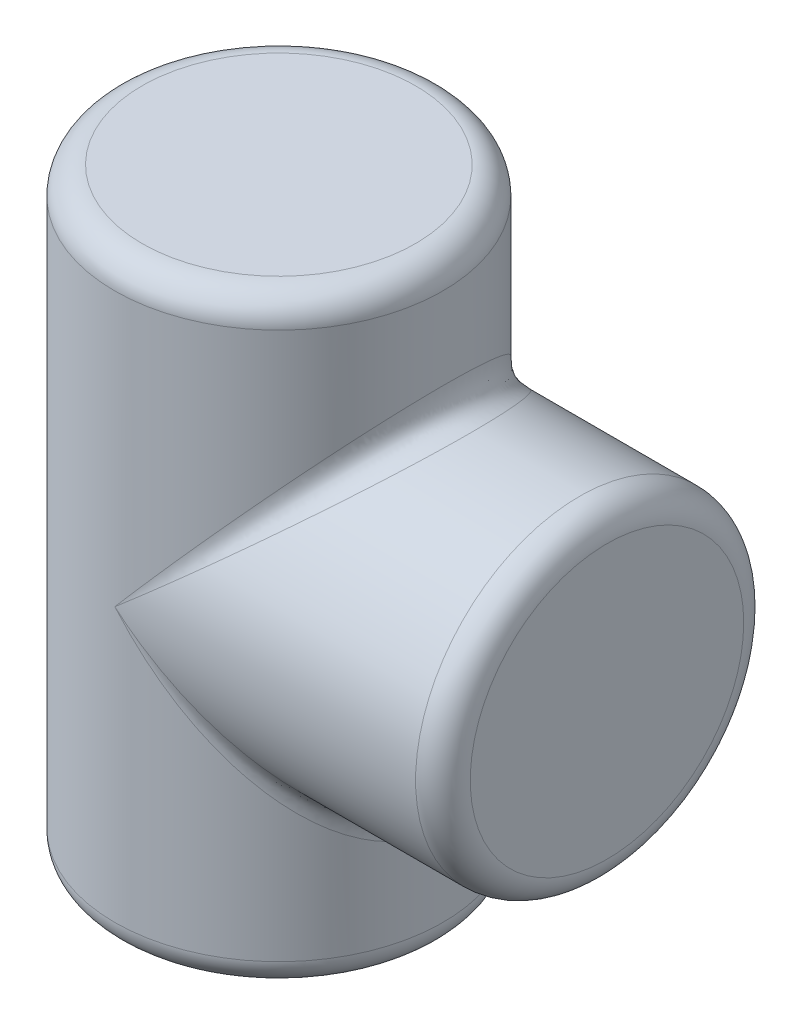
ISO-10303-21;
HEADER;
FILE_DESCRIPTION(('STEP AP214'),'2;1');
FILE_NAME('part.step','',(''),(''),'','','');
FILE_SCHEMA(('AUTOMOTIVE_DESIGN { 1 0 10303 214 1 1 1 1 }'));
ENDSEC;
DATA;
#1=APPLICATION_CONTEXT('core data for automotive mechanical design processes');
#2=APPLICATION_PROTOCOL_DEFINITION('international standard','automotive_design',2000,#1);
#3=PRODUCT_CONTEXT('',#1,'mechanical');
#4=PRODUCT('Part','Part','',(#3));
#5=PRODUCT_RELATED_PRODUCT_CATEGORY('part','',(#4));
#6=PRODUCT_DEFINITION_FORMATION('','',#4);
#7=PRODUCT_DEFINITION_CONTEXT('part definition',#1,'design');
#8=PRODUCT_DEFINITION('design','',#6,#7);
#9=PRODUCT_DEFINITION_SHAPE('','',#8);
#10=(LENGTH_UNIT() NAMED_UNIT(*) SI_UNIT(.MILLI.,.METRE.));
#11=(NAMED_UNIT(*) PLANE_ANGLE_UNIT() SI_UNIT($,.RADIAN.));
#12=(NAMED_UNIT(*) SI_UNIT($,.STERADIAN.) SOLID_ANGLE_UNIT());
#13=UNCERTAINTY_MEASURE_WITH_UNIT(LENGTH_MEASURE(1.E-05),#10,'distance_accuracy_value','');
#14=(GEOMETRIC_REPRESENTATION_CONTEXT(3) GLOBAL_UNCERTAINTY_ASSIGNED_CONTEXT((#13)) GLOBAL_UNIT_ASSIGNED_CONTEXT((#10,
#11,#12)) REPRESENTATION_CONTEXT('',''));
#15=CARTESIAN_POINT('',(0.,0.,0.));
#16=DIRECTION('',(0.,0.,1.));
#17=DIRECTION('',(1.,0.,0.));
#18=AXIS2_PLACEMENT_3D('',#15,#16,#17);
#19=CARTESIAN_POINT('',(0.,220.,0.));
#20=DIRECTION('',(0.,-1.,0.));
#21=DIRECTION('',(0.,0.,-1.));
#22=AXIS2_PLACEMENT_3D('',#19,#20,#21);
#23=CYLINDRICAL_SURFACE('',#22,60.);
#24=CARTESIAN_POINT('',(0.,10.,0.));
#25=DIRECTION('',(0.,1.,0.));
#26=DIRECTION('',(0.,0.,1.));
#27=AXIS2_PLACEMENT_3D('',#24,#25,#26);
#28=CIRCLE('',#27,60.);
#29=CARTESIAN_POINT('',(0.,10.,60.));
#30=VERTEX_POINT('',#29);
#31=EDGE_CURVE('E184',#30,#30,#28,.T.);
#32=ORIENTED_EDGE('',*,*,#31,.T.);
#33=EDGE_LOOP('',(#32));
#34=FACE_BOUND('',#33,.T.);
#35=CARTESIAN_POINT('',(0.,210.,0.));
#36=DIRECTION('',(0.,1.,0.));
#37=DIRECTION('',(0.,0.,1.));
#38=AXIS2_PLACEMENT_3D('',#35,#36,#37);
#39=CIRCLE('',#38,60.);
#40=CARTESIAN_POINT('',(0.,210.,60.));
#41=VERTEX_POINT('',#40);
#42=EDGE_CURVE('E181',#41,#41,#39,.F.);
#43=ORIENTED_EDGE('',*,*,#42,.T.);
#44=EDGE_LOOP('',(#43));
#45=FACE_BOUND('',#44,.T.);
#46=CARTESIAN_POINT('',(0.,110.,-60.));
#47=CARTESIAN_POINT('',(3.92699081712083,114.581489286634,-60.));
#48=CARTESIAN_POINT('',(11.7808596037151,123.744336204337,-59.226456743875));
#49=CARTESIAN_POINT('',(23.1090210871226,136.960524601642,-55.7901023416001));
#50=CARTESIAN_POINT('',(33.5490916992271,149.140606982432,-50.2097655937874));
#51=CARTESIAN_POINT('',(42.6998960030261,159.816545336864,-42.6998957121664));
#52=CARTESIAN_POINT('',(50.209765515825,168.578059768462,-33.5490927847041));
#53=CARTESIAN_POINT('',(55.79010236259,175.088452756355,-23.1090170360737));
#54=CARTESIAN_POINT('',(59.2264567378779,179.097532860858,-11.780874722433));
#55=CARTESIAN_POINT('',(60.386771631061,180.451233569571,-1.05978448090734E-13));
#56=CARTESIAN_POINT('',(59.2264567378779,179.097532860858,11.7808747224331));
#57=CARTESIAN_POINT('',(55.79010236259,175.088452756355,23.1090170360738));
#58=CARTESIAN_POINT('',(50.2097655158249,168.578059768462,33.5490927847042));
#59=CARTESIAN_POINT('',(42.6998960030264,159.816545336864,42.6998957121662));
#60=CARTESIAN_POINT('',(33.5490916992269,149.14060698243,50.2097655937875));
#61=CARTESIAN_POINT('',(23.1090210871227,136.960524601648,55.7901023416001));
#62=CARTESIAN_POINT('',(11.7808596037149,123.744336204316,59.2264567438751));
#63=CARTESIAN_POINT('',(3.92699081712081,114.581489286679,59.9999999999999));
#64=CARTESIAN_POINT('',(0.,110.,59.9999999999999));
#65=B_SPLINE_CURVE_WITH_KNOTS('',3,(#46,#47,#48,#49,#50,#51,#52,#53,#54,#55,#56,#57,#58,#59,#60,
#61,#62,#63,#64),.UNSPECIFIED.,.F.,.F.,(4,1,1,1,1,1,1,1,1,1,1,1,1,1,1,1,4),(1.5707963267949,
1.76714586764426,1.96349540849362,2.15984494934298,2.35619449019235,2.55254403104171,
2.74889357189107,2.94524311274043,3.14159265358979,3.33794219443915,3.53429173528852,
3.73064127613788,3.92699081698724,4.1233403578366,4.31968989868597,4.51603943953533,
4.71238898038469),.UNSPECIFIED.);
#66=CARTESIAN_POINT('',(0.,110.,60.));
#67=VERTEX_POINT('',#66);
#68=CARTESIAN_POINT('',(0.,110.,-60.));
#69=VERTEX_POINT('',#68);
#70=EDGE_CURVE('E63',#67,#69,#65,.F.);
#71=ORIENTED_EDGE('',*,*,#70,.T.);
#72=CARTESIAN_POINT('',(0.,110.,60.));
#73=CARTESIAN_POINT('',(3.92699081712083,105.418510713366,60.));
#74=CARTESIAN_POINT('',(11.7808596037151,96.2556637956627,59.226456743875));
#75=CARTESIAN_POINT('',(23.1090210871226,83.0394753983578,55.7901023416002));
#76=CARTESIAN_POINT('',(33.5490916992271,70.8593930175682,50.2097655937874));
#77=CARTESIAN_POINT('',(42.6998960030262,60.1834546631362,42.6998957121664));
#78=CARTESIAN_POINT('',(50.209765515825,51.4219402315375,33.5490927847041));
#79=CARTESIAN_POINT('',(55.7901023625901,44.9115472436449,23.1090170360737));
#80=CARTESIAN_POINT('',(59.226456737878,40.9024671391424,11.780874722433));
#81=CARTESIAN_POINT('',(60.386771631061,39.5487664304288,1.05978448090734E-13));
#82=CARTESIAN_POINT('',(59.226456737878,40.9024671391424,-11.7808747224331));
#83=CARTESIAN_POINT('',(55.79010236259,44.911547243645,-23.1090170360738));
#84=CARTESIAN_POINT('',(50.2097655158249,51.4219402315377,-33.5490927847042));
#85=CARTESIAN_POINT('',(42.6998960030264,60.1834546631356,-42.6998957121663));
#86=CARTESIAN_POINT('',(33.5490916992269,70.8593930175699,-50.2097655937875));
#87=CARTESIAN_POINT('',(23.1090210871227,83.0394753983522,-55.7901023416001));
#88=CARTESIAN_POINT('',(11.7808596037149,96.2556637956838,-59.2264567438751));
#89=CARTESIAN_POINT('',(3.92699081712081,105.418510713321,-60.));
#90=CARTESIAN_POINT('',(0.,110.,-60.));
#91=B_SPLINE_CURVE_WITH_KNOTS('',3,(#72,#73,#74,#75,#76,#77,#78,#79,#80,#81,#82,#83,#84,#85,#86,
#87,#88,#89,#90),.UNSPECIFIED.,.F.,.F.,(4,1,1,1,1,1,1,1,1,1,1,1,1,1,1,1,4),(1.5707963267949,
1.76714586764426,1.96349540849362,2.15984494934298,2.35619449019235,2.55254403104171,
2.74889357189107,2.94524311274043,3.14159265358979,3.33794219443915,3.53429173528852,
3.73064127613788,3.92699081698724,4.1233403578366,4.31968989868597,4.51603943953533,
4.71238898038469),.UNSPECIFIED.);
#92=EDGE_CURVE('E57',#69,#67,#91,.F.);
#93=ORIENTED_EDGE('',*,*,#92,.T.);
#94=EDGE_LOOP('',(#71,#93));
#95=FACE_BOUND('',#94,.T.);
#96=ADVANCED_FACE('F43',(#34,#45,#95),#23,.T.);
#97=CARTESIAN_POINT('',(0.,220.,0.));
#98=DIRECTION('',(0.,1.,0.));
#99=DIRECTION('',(0.,0.,1.));
#100=AXIS2_PLACEMENT_3D('',#97,#98,#99);
#101=PLANE('',#100);
#102=CARTESIAN_POINT('',(0.,220.,0.));
#103=DIRECTION('',(0.,1.,0.));
#104=DIRECTION('',(0.,0.,1.));
#105=AXIS2_PLACEMENT_3D('',#102,#103,#104);
#106=CIRCLE('',#105,50.);
#107=CARTESIAN_POINT('',(0.,220.,50.));
#108=VERTEX_POINT('',#107);
#109=EDGE_CURVE('E12',#108,#108,#106,.T.);
#110=ORIENTED_EDGE('',*,*,#109,.T.);
#111=EDGE_LOOP('',(#110));
#112=FACE_BOUND('',#111,.T.);
#113=ADVANCED_FACE('F198',(#112),#101,.T.);
#114=CARTESIAN_POINT('',(0.,0.,0.));
#115=DIRECTION('',(0.,1.,0.));
#116=DIRECTION('',(0.,0.,1.));
#117=AXIS2_PLACEMENT_3D('',#114,#115,#116);
#118=PLANE('',#117);
#119=CARTESIAN_POINT('',(0.,0.,0.));
#120=DIRECTION('',(0.,1.,0.));
#121=DIRECTION('',(0.,0.,1.));
#122=AXIS2_PLACEMENT_3D('',#119,#120,#121);
#123=CIRCLE('',#122,50.);
#124=CARTESIAN_POINT('',(0.,0.,50.));
#125=VERTEX_POINT('',#124);
#126=EDGE_CURVE('E51',#125,#125,#123,.F.);
#127=ORIENTED_EDGE('',*,*,#126,.T.);
#128=EDGE_LOOP('',(#127));
#129=FACE_BOUND('',#128,.T.);
#130=ADVANCED_FACE('F189',(#129),#118,.F.);
#131=CARTESIAN_POINT('',(120.,110.,0.));
#132=DIRECTION('',(-1.,0.,0.));
#133=DIRECTION('',(0.,0.,1.));
#134=AXIS2_PLACEMENT_3D('',#131,#132,#133);
#135=CYLINDRICAL_SURFACE('',#134,60.);
#136=CARTESIAN_POINT('',(110.,110.,0.));
#137=DIRECTION('',(1.,0.,0.));
#138=DIRECTION('',(0.,0.,-1.));
#139=AXIS2_PLACEMENT_3D('',#136,#137,#138);
#140=CIRCLE('',#139,60.);
#141=CARTESIAN_POINT('',(110.,110.,-60.));
#142=VERTEX_POINT('',#141);
#143=EDGE_CURVE('E178',#142,#142,#140,.F.);
#144=ORIENTED_EDGE('',*,*,#143,.T.);
#145=EDGE_LOOP('',(#144));
#146=FACE_BOUND('',#145,.T.);
#147=CARTESIAN_POINT('',(0.,110.,60.));
#148=CARTESIAN_POINT('',(4.58148928664094,113.926990817147,60.));
#149=CARTESIAN_POINT('',(13.744336204334,121.780859603703,59.2264567438751));
#150=CARTESIAN_POINT('',(26.9605246016431,133.109021087126,55.7901023416001));
#151=CARTESIAN_POINT('',(39.1406069824314,143.549091699226,50.2097655937875));
#152=CARTESIAN_POINT('',(49.8165453368641,152.699896003027,42.6998957121663));
#153=CARTESIAN_POINT('',(58.5780597684624,160.209765515825,33.5490927847042));
#154=CARTESIAN_POINT('',(65.0884527563551,165.79010236259,23.1090170360738));
#155=CARTESIAN_POINT('',(69.0975328608576,169.226456737878,11.7808747224331));
#156=CARTESIAN_POINT('',(70.4512335695712,170.386771631061,-1.05281221458558E-13));
#157=CARTESIAN_POINT('',(69.0975328608576,169.226456737878,-11.780874722433));
#158=CARTESIAN_POINT('',(65.0884527563551,165.79010236259,-23.1090170360737));
#159=CARTESIAN_POINT('',(58.5780597684625,160.209765515825,-33.5490927847041));
#160=CARTESIAN_POINT('',(49.8165453368639,152.699896003026,-42.6998957121664));
#161=CARTESIAN_POINT('',(39.1406069824316,143.549091699228,-50.2097655937874));
#162=CARTESIAN_POINT('',(26.9605246016431,133.10902108712,-55.7901023416002));
#163=CARTESIAN_POINT('',(13.7443362043342,121.780859603724,-59.226456743875));
#164=CARTESIAN_POINT('',(4.58148928664096,113.926990817102,-60.));
#165=CARTESIAN_POINT('',(0.,110.,-60.));
#166=B_SPLINE_CURVE_WITH_KNOTS('',3,(#147,#148,#149,#150,#151,#152,#153,#154,#155,#156,#157,
#158,#159,#160,#161,#162,#163,#164,#165),.UNSPECIFIED.,.F.,.F.,(4,1,1,1,1,1,1,1,1,1,1,1,1,1,1,1,
4),(1.5707963267949,1.76714586764426,1.96349540849362,2.15984494934298,2.35619449019234,
2.55254403104171,2.74889357189107,2.94524311274043,3.14159265358979,3.33794219443915,
3.53429173528852,3.73064127613788,3.92699081698724,4.1233403578366,4.31968989868597,
4.51603943953533,4.71238898038469),.UNSPECIFIED.);
#167=EDGE_CURVE('E67',#69,#67,#166,.F.);
#168=ORIENTED_EDGE('',*,*,#167,.T.);
#169=CARTESIAN_POINT('',(0.,110.,-60.));
#170=CARTESIAN_POINT('',(4.58148928664094,106.073009182853,-60.));
#171=CARTESIAN_POINT('',(13.744336204334,98.2191403962975,-59.2264567438751));
#172=CARTESIAN_POINT('',(26.9605246016431,86.890978912874,-55.7901023416001));
#173=CARTESIAN_POINT('',(39.1406069824314,76.450908300774,-50.2097655937875));
#174=CARTESIAN_POINT('',(49.8165453368641,67.3001039969733,-42.6998957121663));
#175=CARTESIAN_POINT('',(58.5780597684624,59.7902344841752,-33.5490927847042));
#176=CARTESIAN_POINT('',(65.088452756355,54.20989763741,-23.1090170360738));
#177=CARTESIAN_POINT('',(69.0975328608576,50.773543262122,-11.7808747224331));
#178=CARTESIAN_POINT('',(70.4512335695711,49.613228368939,1.05978448090734E-13));
#179=CARTESIAN_POINT('',(69.0975328608576,50.773543262122,11.780874722433));
#180=CARTESIAN_POINT('',(65.088452756355,54.20989763741,23.1090170360736));
#181=CARTESIAN_POINT('',(58.5780597684625,59.7902344841749,33.5490927847041));
#182=CARTESIAN_POINT('',(49.8165453368639,67.3001039969739,42.6998957121664));
#183=CARTESIAN_POINT('',(39.1406069824316,76.4509083007724,50.2097655937874));
#184=CARTESIAN_POINT('',(26.9605246016431,86.8909789128797,55.7901023416002));
#185=CARTESIAN_POINT('',(13.7443362043342,98.2191403962764,59.226456743875));
#186=CARTESIAN_POINT('',(4.58148928664096,106.073009182898,60.));
#187=CARTESIAN_POINT('',(0.,110.,60.));
#188=B_SPLINE_CURVE_WITH_KNOTS('',3,(#169,#170,#171,#172,#173,#174,#175,#176,#177,#178,#179,
#180,#181,#182,#183,#184,#185,#186,#187),.UNSPECIFIED.,.F.,.F.,(4,1,1,1,1,1,1,1,1,1,1,1,1,1,1,1,
4),(1.5707963267949,1.76714586764426,1.96349540849362,2.15984494934298,2.35619449019234,
2.55254403104171,2.74889357189107,2.94524311274043,3.14159265358979,3.33794219443915,
3.53429173528852,3.73064127613788,3.92699081698724,4.1233403578366,4.31968989868597,
4.51603943953533,4.71238898038469),.UNSPECIFIED.);
#189=EDGE_CURVE('E72',#67,#69,#188,.F.);
#190=ORIENTED_EDGE('',*,*,#189,.T.);
#191=EDGE_LOOP('',(#168,#190));
#192=FACE_BOUND('',#191,.T.);
#193=ADVANCED_FACE('F81',(#146,#192),#135,.T.);
#194=CARTESIAN_POINT('',(120.,110.,0.));
#195=DIRECTION('',(1.,0.,0.));
#196=DIRECTION('',(0.,0.,-1.));
#197=AXIS2_PLACEMENT_3D('',#194,#195,#196);
#198=PLANE('',#197);
#199=CARTESIAN_POINT('',(120.,110.,0.));
#200=DIRECTION('',(1.,0.,0.));
#201=DIRECTION('',(0.,0.,-1.));
#202=AXIS2_PLACEMENT_3D('',#199,#200,#201);
#203=CIRCLE('',#202,50.);
#204=CARTESIAN_POINT('',(120.,110.,-50.));
#205=VERTEX_POINT('',#204);
#206=EDGE_CURVE('E76',#205,#205,#203,.T.);
#207=ORIENTED_EDGE('',*,*,#206,.T.);
#208=EDGE_LOOP('',(#207));
#209=FACE_BOUND('',#208,.T.);
#210=ADVANCED_FACE('F107',(#209),#198,.T.);
#211=CARTESIAN_POINT('',(0.,110.,-60.));
#212=CARTESIAN_POINT('',(3.92699081712081,105.418510713321,-60.));
#213=CARTESIAN_POINT('',(11.7808596037149,96.2556637956838,-59.2264567438751));
#214=CARTESIAN_POINT('',(23.1090210871227,83.0394753983522,-55.7901023416001));
#215=CARTESIAN_POINT('',(33.5490916992269,70.8593930175699,-50.2097655937875));
#216=CARTESIAN_POINT('',(42.6998960030264,60.1834546631356,-42.6998957121663));
#217=CARTESIAN_POINT('',(50.2097655158249,51.4219402315377,-33.5490927847042));
#218=CARTESIAN_POINT('',(55.79010236259,44.911547243645,-23.1090170360738));
#219=CARTESIAN_POINT('',(59.226456737878,40.9024671391424,-11.7808747224331));
#220=CARTESIAN_POINT('',(60.386771631061,39.5487664304288,1.05978448090734E-13));
#221=CARTESIAN_POINT('',(59.226456737878,40.9024671391424,11.780874722433));
#222=CARTESIAN_POINT('',(55.7901023625901,44.9115472436449,23.1090170360737));
#223=CARTESIAN_POINT('',(50.209765515825,51.4219402315375,33.5490927847041));
#224=CARTESIAN_POINT('',(42.6998960030262,60.1834546631362,42.6998957121664));
#225=CARTESIAN_POINT('',(33.5490916992271,70.8593930175682,50.2097655937874));
#226=CARTESIAN_POINT('',(23.1090210871226,83.0394753983578,55.7901023416002));
#227=CARTESIAN_POINT('',(11.7808596037151,96.2556637956627,59.226456743875));
#228=CARTESIAN_POINT('',(3.92699081712083,105.418510713366,60.));
#229=CARTESIAN_POINT('',(0.,110.,60.));
#230=CARTESIAN_POINT('',(0.,110.,-60.));
#231=CARTESIAN_POINT('',(3.98664350439752,105.478163400681,-60.));
#232=CARTESIAN_POINT('',(11.9598067333234,96.4346231816255,-59.2026698226563));
#233=CARTESIAN_POINT('',(23.4366661492895,83.4083624080886,-55.6658036348682));
#234=CARTESIAN_POINT('',(33.9672536338786,71.4398826461201,-49.940556555725));
#235=CARTESIAN_POINT('',(43.1285251101186,61.0059540611247,-42.2780768391377));
#236=CARTESIAN_POINT('',(50.5603217487232,52.5179222028681,-33.0223427189622));
#237=CARTESIAN_POINT('',(55.9925249554958,46.292588167711,-22.5948226481385));
#238=CARTESIAN_POINT('',(59.2726561138483,42.5204499292783,-11.4517840915429));
#239=CARTESIAN_POINT('',(60.3636719431626,41.2627458084568,1.02840928245942E-13));
#240=CARTESIAN_POINT('',(59.2726561135012,42.5204499289312,11.4517840915428));
#241=CARTESIAN_POINT('',(55.9925249568844,46.2925881690995,22.5948226481384));
#242=CARTESIAN_POINT('',(50.5603217435161,52.5179221976609,33.0223427189621));
#243=CARTESIAN_POINT('',(43.1285251295583,61.0059540805644,42.2780768391379));
#244=CARTESIAN_POINT('',(33.9672535613259,71.439882573569,49.9405565557249));
#245=CARTESIAN_POINT('',(23.4366664200611,83.4083626788532,55.6658036348683));
#246=CARTESIAN_POINT('',(11.9598057227903,96.434622171118,59.2026698226562));
#247=CARTESIAN_POINT('',(3.98664568179429,105.478165578022,60.));
#248=CARTESIAN_POINT('',(0.,110.,60.));
#249=CARTESIAN_POINT('',(0.,110.,-60.));
#250=CARTESIAN_POINT('',(4.04686954777942,105.538389444159,-60.0000000000449));
#251=CARTESIAN_POINT('',(12.1404732791835,96.6153034854527,-59.1781965445143));
#252=CARTESIAN_POINT('',(23.7668429009911,83.7809451990786,-55.538028470656));
#253=CARTESIAN_POINT('',(34.3871044127039,72.0263629396363,-49.6643091010797));
#254=CARTESIAN_POINT('',(43.5561886856421,61.8366433788965,-41.8466912831429));
#255=CARTESIAN_POINT('',(50.9066788377484,53.6229692764953,-32.4867099293013));
#256=CARTESIAN_POINT('',(56.1898875987137,47.6805218637506,-22.0761702647969));
#257=CARTESIAN_POINT('',(59.3170604158285,44.1403702604925,-11.1225639180764));
#258=CARTESIAN_POINT('',(60.3414697922509,42.9757564159374,1.01097861665503E-13));
#259=CARTESIAN_POINT('',(59.3170604151677,44.1403702598317,11.1225639180762));
#260=CARTESIAN_POINT('',(56.1898876013569,47.6805218663937,22.0761702647967));
#261=CARTESIAN_POINT('',(50.9066788278365,53.6229692665834,32.4867099293012));
#262=CARTESIAN_POINT('',(43.5561887226466,61.8366434159008,41.846691283143));
#263=CARTESIAN_POINT('',(34.3871042745972,72.0263628015316,49.6643091010796));
#264=CARTESIAN_POINT('',(23.7668434164141,83.780945714493,55.5380284706561));
#265=CARTESIAN_POINT('',(12.1404713555985,96.6153015618998,59.1781965445142));
#266=CARTESIAN_POINT('',(4.04687369252963,105.538393588839,60.0000000000449));
#267=CARTESIAN_POINT('',(0.,110.,60.));
#268=CARTESIAN_POINT('',(0.,110.,-60.));
#269=CARTESIAN_POINT('',(4.185115550115,105.676635446181,-60.));
#270=CARTESIAN_POINT('',(12.5552015914663,97.0300582587543,-59.1337733520056));
#271=CARTESIAN_POINT('',(24.5457764249555,84.6368193595633,-55.3062373465043));
#272=CARTESIAN_POINT('',(35.431632323889,73.3728568602339,-49.163817959606));
#273=CARTESIAN_POINT('',(44.72756258341,63.7367147535694,-41.0670280507507));
#274=CARTESIAN_POINT('',(52.0468955405248,56.129653835681,-31.5226302269018));
#275=CARTESIAN_POINT('',(57.1668305825163,50.7899725703402,-21.1481775894253));
#276=CARTESIAN_POINT('',(60.0949697545576,47.7241738046179,-10.5371108862564));
#277=CARTESIAN_POINT('',(61.0278939202635,46.7445148154905,0.));
#278=CARTESIAN_POINT('',(60.0949697545533,47.7241738046134,10.5371108862563));
#279=CARTESIAN_POINT('',(57.1668305825337,50.7899725703577,21.1481775894251));
#280=CARTESIAN_POINT('',(52.0468955404598,56.1296538356151,31.5226302269017));
#281=CARTESIAN_POINT('',(44.727562583653,63.7367147538152,41.0670280507509));
#282=CARTESIAN_POINT('',(35.4316323229812,73.372856859317,49.1638179596058));
#283=CARTESIAN_POINT('',(24.545776428344,84.6368193629849,55.3062373465043));
#284=CARTESIAN_POINT('',(12.5552015788204,97.0300582459846,59.1337733520055));
#285=CARTESIAN_POINT('',(4.18511557736371,105.676635473695,60.));
#286=CARTESIAN_POINT('',(0.,110.,60.));
#287=CARTESIAN_POINT('',(0.,110.,-60.));
#288=CARTESIAN_POINT('',(4.32336303690225,105.814882933227,-60.));
#289=CARTESIAN_POINT('',(12.9699424452493,97.444799112417,-59.1337733520056));
#290=CARTESIAN_POINT('',(25.3631804517995,85.4542233864395,-55.3062373465043));
#291=CARTESIAN_POINT('',(36.6271431903115,74.5683677266478,-49.163817959606));
#292=CARTESIAN_POINT('',(46.2632852328862,65.272437403048,-41.0670280507507));
#293=CARTESIAN_POINT('',(53.8703461679513,57.9531044631068,-31.5226302269018));
#294=CARTESIAN_POINT('',(59.2100274286751,52.8331694164991,-21.1481775894253));
#295=CARTESIAN_POINT('',(62.2758261956888,49.905030245749,-10.5371108862564));
#296=CARTESIAN_POINT('',(63.2554851842678,48.9721060794947,0.));
#297=CARTESIAN_POINT('',(62.2758261960472,49.9050302461074,10.5371108862563));
#298=CARTESIAN_POINT('',(59.2100274272415,52.8331694150654,21.1481775894251));
#299=CARTESIAN_POINT('',(53.8703461733276,57.953104468483,31.5226302269017));
#300=CARTESIAN_POINT('',(46.2632852128148,65.2724373829767,41.0670280507509));
#301=CARTESIAN_POINT('',(36.6271432652204,74.5683678015567,49.1638179596058));
#302=CARTESIAN_POINT('',(25.3631801722361,85.4542231068749,55.3062373465043));
#303=CARTESIAN_POINT('',(12.9699434885944,97.4448001557662,59.1337733520055));
#304=CARTESIAN_POINT('',(4.32336078880647,105.814880685122,60.));
#305=CARTESIAN_POINT('',(0.,110.,60.));
#306=CARTESIAN_POINT('',(0.,110.,-60.));
#307=CARTESIAN_POINT('',(4.46161200877443,105.953131904849,-59.999999999955));
#308=CARTESIAN_POINT('',(13.3846958402386,97.8595260466494,-59.178196544556));
#309=CARTESIAN_POINT('',(26.2190549816019,86.2331572796515,-55.5380284706449));
#310=CARTESIAN_POINT('',(37.9736370119503,75.6128955388929,-49.6643091010827));
#311=CARTESIAN_POINT('',(48.1633566340765,66.4438113273281,-41.8466912831421));
#312=CARTESIAN_POINT('',(56.3770307200262,59.0933211587739,-32.4867099293015));
#313=CARTESIAN_POINT('',(62.3194781371904,53.8101124022271,-22.0761702647968));
#314=CARTESIAN_POINT('',(65.8596297392219,50.682939583886,-11.1225639180764));
#315=CARTESIAN_POINT('',(67.0242435842637,49.6585302079502,1.05629834774646E-13));
#316=CARTESIAN_POINT('',(65.8596297396495,50.6829395843135,11.1225639180762));
#317=CARTESIAN_POINT('',(62.3194781354803,53.810112400517,22.0761702647967));
#318=CARTESIAN_POINT('',(56.3770307264394,59.0933211651866,32.4867099293012));
#319=CARTESIAN_POINT('',(48.1633566101343,66.4438113033872,41.846691283143));
#320=CARTESIAN_POINT('',(37.9736371013055,75.6128956282445,49.6643091010796));
#321=CARTESIAN_POINT('',(26.219054648124,86.2331569461856,55.5380284706561));
#322=CARTESIAN_POINT('',(13.3846970847956,97.8595272911611,59.1781965445142));
#323=CARTESIAN_POINT('',(4.4616093271271,105.953129223298,60.0000000000449));
#324=CARTESIAN_POINT('',(0.,110.,60.));
#325=CARTESIAN_POINT('',(0.,110.,-60.));
#326=CARTESIAN_POINT('',(4.52183736823546,106.013357264328,-60.));
#327=CARTESIAN_POINT('',(13.565376461519,98.0401929099101,-59.2026698226563));
#328=CARTESIAN_POINT('',(26.5916376875306,86.5633339463058,-55.6658036348682));
#329=CARTESIAN_POINT('',(38.5601173282587,76.0327463405066,-49.940556555725));
#330=CARTESIAN_POINT('',(48.9940459457408,66.8714748967453,-42.2780768391377));
#331=CARTESIAN_POINT('',(57.4820777952911,59.4396782494364,-33.0223427189622));
#332=CARTESIAN_POINT('',(63.7074118327871,54.0074750450021,-22.5948226481385));
#333=CARTESIAN_POINT('',(67.4795500705705,50.7273438860005,-11.4517840915429));
#334=CARTESIAN_POINT('',(68.7372541916499,49.6363280569441,1.03538154878118E-13));
#335=CARTESIAN_POINT('',(67.4795500707933,50.7273438862233,11.4517840915428));
#336=CARTESIAN_POINT('',(63.7074118318958,54.0074750441108,22.5948226481384));
#337=CARTESIAN_POINT('',(57.4820777986337,59.4396782527785,33.0223427189621));
#338=CARTESIAN_POINT('',(48.994045933262,66.8714748842681,42.2780768391379));
#339=CARTESIAN_POINT('',(38.5601173748307,76.0327463870736,49.9405565557249));
#340=CARTESIAN_POINT('',(26.5916375137221,86.5633337725145,55.6658036348683));
#341=CARTESIAN_POINT('',(13.5653771101816,98.0401935585082,59.2026698226562));
#342=CARTESIAN_POINT('',(4.52183597056237,106.013355866792,60.));
#343=CARTESIAN_POINT('',(0.,110.,60.));
#344=CARTESIAN_POINT('',(0.,110.,-60.));
#345=CARTESIAN_POINT('',(4.58148928664094,106.073009182853,-60.));
#346=CARTESIAN_POINT('',(13.744336204334,98.2191403962975,-59.2264567438751));
#347=CARTESIAN_POINT('',(26.9605246016431,86.890978912874,-55.7901023416001));
#348=CARTESIAN_POINT('',(39.1406069824314,76.450908300774,-50.2097655937875));
#349=CARTESIAN_POINT('',(49.8165453368641,67.3001039969734,-42.6998957121663));
#350=CARTESIAN_POINT('',(58.5780597684624,59.7902344841752,-33.5490927847042));
#351=CARTESIAN_POINT('',(65.0884527563551,54.20989763741,-23.1090170360738));
#352=CARTESIAN_POINT('',(69.0975328608576,50.773543262122,-11.7808747224331));
#353=CARTESIAN_POINT('',(70.4512335695712,49.613228368939,1.05978448090734E-13));
#354=CARTESIAN_POINT('',(69.0975328608576,50.773543262122,11.780874722433));
#355=CARTESIAN_POINT('',(65.0884527563551,54.20989763741,23.1090170360737));
#356=CARTESIAN_POINT('',(58.5780597684625,59.7902344841749,33.5490927847041));
#357=CARTESIAN_POINT('',(49.8165453368639,67.300103996974,42.6998957121664));
#358=CARTESIAN_POINT('',(39.1406069824316,76.4509083007724,50.2097655937874));
#359=CARTESIAN_POINT('',(26.9605246016431,86.8909789128797,55.7901023416002));
#360=CARTESIAN_POINT('',(13.7443362043342,98.2191403962764,59.226456743875));
#361=CARTESIAN_POINT('',(4.58148928664096,106.073009182898,60.));
#362=CARTESIAN_POINT('',(0.,110.,60.));
#363=B_SPLINE_SURFACE_WITH_KNOTS('',5,3,((#211,#212,#213,#214,#215,#216,#217,#218,#219,#220,
#221,#222,#223,#224,#225,#226,#227,#228,#229),(#230,#231,#232,#233,#234,#235,#236,#237,#238,
#239,#240,#241,#242,#243,#244,#245,#246,#247,#248),(#249,#250,#251,#252,#253,#254,#255,#256,
#257,#258,#259,#260,#261,#262,#263,#264,#265,#266,#267),(#268,#269,#270,#271,#272,#273,#274,
#275,#276,#277,#278,#279,#280,#281,#282,#283,#284,#285,#286),(#287,#288,#289,#290,#291,#292,
#293,#294,#295,#296,#297,#298,#299,#300,#301,#302,#303,#304,#305),(#306,#307,#308,#309,#310,
#311,#312,#313,#314,#315,#316,#317,#318,#319,#320,#321,#322,#323,#324),(#325,#326,#327,#328,
#329,#330,#331,#332,#333,#334,#335,#336,#337,#338,#339,#340,#341,#342,#343),(#344,#345,#346,
#347,#348,#349,#350,#351,#352,#353,#354,#355,#356,#357,#358,#359,#360,#361,#362)),.UNSPECIFIED.,
.F.,.F.,.F.,(6,2,6),(4,1,1,1,1,1,1,1,1,1,1,1,1,1,1,1,4),(0.,0.5,1.),(1.5707963267949,
1.76714586764426,1.96349540849362,2.15984494934298,2.35619449019234,2.55254403104171,
2.74889357189107,2.94524311274043,3.14159265358979,3.33794219443915,3.53429173528852,
3.73064127613788,3.92699081698724,4.1233403578366,4.31968989868597,4.51603943953533,
4.71238898038469),.UNSPECIFIED.);
#364=ORIENTED_EDGE('',*,*,#189,.F.);
#365=ORIENTED_EDGE('',*,*,#92,.F.);
#366=EDGE_LOOP('',(#364,#365));
#367=FACE_BOUND('',#366,.T.);
#368=ADVANCED_FACE('F85',(#367),#363,.T.);
#369=CARTESIAN_POINT('',(0.,110.,60.));
#370=CARTESIAN_POINT('',(3.92699081712081,114.581489286679,60.));
#371=CARTESIAN_POINT('',(11.7808596037149,123.744336204316,59.2264567438751));
#372=CARTESIAN_POINT('',(23.1090210871227,136.960524601648,55.7901023416001));
#373=CARTESIAN_POINT('',(33.5490916992269,149.14060698243,50.2097655937875));
#374=CARTESIAN_POINT('',(42.6998960030264,159.816545336864,42.6998957121663));
#375=CARTESIAN_POINT('',(50.2097655158249,168.578059768462,33.5490927847042));
#376=CARTESIAN_POINT('',(55.79010236259,175.088452756355,23.1090170360738));
#377=CARTESIAN_POINT('',(59.226456737878,179.097532860858,11.7808747224331));
#378=CARTESIAN_POINT('',(60.386771631061,180.451233569571,-1.05978448090734E-13));
#379=CARTESIAN_POINT('',(59.226456737878,179.097532860858,-11.780874722433));
#380=CARTESIAN_POINT('',(55.7901023625901,175.088452756355,-23.1090170360737));
#381=CARTESIAN_POINT('',(50.209765515825,168.578059768463,-33.5490927847041));
#382=CARTESIAN_POINT('',(42.6998960030262,159.816545336864,-42.6998957121664));
#383=CARTESIAN_POINT('',(33.5490916992271,149.140606982432,-50.2097655937874));
#384=CARTESIAN_POINT('',(23.1090210871226,136.960524601642,-55.7901023416002));
#385=CARTESIAN_POINT('',(11.7808596037151,123.744336204337,-59.226456743875));
#386=CARTESIAN_POINT('',(3.92699081712083,114.581489286634,-60.));
#387=CARTESIAN_POINT('',(0.,110.,-60.));
#388=CARTESIAN_POINT('',(0.,110.,60.));
#389=CARTESIAN_POINT('',(3.9866435043802,114.521836599499,60.));
#390=CARTESIAN_POINT('',(11.9598067333314,123.565376818291,59.2026698226563));
#391=CARTESIAN_POINT('',(23.4366661492874,136.591637591934,55.6658036348682));
#392=CARTESIAN_POINT('',(33.9672536338792,148.560117353874,49.940556555725));
#393=CARTESIAN_POINT('',(43.1285251101184,158.994045938877,42.2780768391377));
#394=CARTESIAN_POINT('',(50.5603217487232,167.482077797132,33.0223427189622));
#395=CARTESIAN_POINT('',(55.9925249554958,173.707411832289,22.5948226481385));
#396=CARTESIAN_POINT('',(59.2726561138483,177.479550070722,11.4517840915429));
#397=CARTESIAN_POINT('',(60.3636719431626,178.737254191543,-1.03538154878118E-13));
#398=CARTESIAN_POINT('',(59.2726561135012,177.479550071069,-11.4517840915428));
#399=CARTESIAN_POINT('',(55.9925249568844,173.707411830901,-22.5948226481384));
#400=CARTESIAN_POINT('',(50.5603217435161,167.482077802339,-33.0223427189621));
#401=CARTESIAN_POINT('',(43.1285251295584,158.994045919436,-42.2780768391379));
#402=CARTESIAN_POINT('',(33.9672535613259,148.560117426431,-49.9405565557249));
#403=CARTESIAN_POINT('',(23.436666420061,136.591637321147,-55.6658036348683));
#404=CARTESIAN_POINT('',(11.9598057227903,123.565377828882,-59.2026698226562));
#405=CARTESIAN_POINT('',(3.98664568179429,114.521834421978,-60.));
#406=CARTESIAN_POINT('',(0.,110.,-60.));
#407=CARTESIAN_POINT('',(0.,110.,60.));
#408=CARTESIAN_POINT('',(4.04686954774621,114.461610556201,60.0000000000449));
#409=CARTESIAN_POINT('',(12.1404732791989,123.38469651438,59.1781965445143));
#410=CARTESIAN_POINT('',(23.766842900987,136.219054800966,55.5380284706561));
#411=CARTESIAN_POINT('',(34.387104412705,147.973637060352,49.6643091010797));
#412=CARTESIAN_POINT('',(43.5561886856419,158.163356621107,41.8466912831428));
#413=CARTESIAN_POINT('',(50.9066788377484,166.377030723504,32.4867099293013));
#414=CARTESIAN_POINT('',(56.1898875987137,172.31947813625,22.0761702647969));
#415=CARTESIAN_POINT('',(59.3170604158285,175.859629739507,11.1225639180764));
#416=CARTESIAN_POINT('',(60.3414697922509,177.024243584063,-1.00749248349415E-13));
#417=CARTESIAN_POINT('',(59.3170604151677,175.859629740168,-11.1225639180762));
#418=CARTESIAN_POINT('',(56.1898876013569,172.319478133606,-22.0761702647967));
#419=CARTESIAN_POINT('',(50.9066788278365,166.377030733417,-32.4867099293012));
#420=CARTESIAN_POINT('',(43.5561887226467,158.163356584099,-41.846691283143));
#421=CARTESIAN_POINT('',(34.3871042745971,147.973637198468,-49.6643091010796));
#422=CARTESIAN_POINT('',(23.7668434164141,136.219054285507,-55.5380284706561));
#423=CARTESIAN_POINT('',(12.1404713555985,123.3846984381,-59.1781965445142));
#424=CARTESIAN_POINT('',(4.04687369252963,114.461606411161,-60.0000000000449));
#425=CARTESIAN_POINT('',(0.,110.,-60.));
#426=CARTESIAN_POINT('',(0.,110.,60.));
#427=CARTESIAN_POINT('',(4.18511555000618,114.323364553639,60.));
#428=CARTESIAN_POINT('',(12.5552015915168,122.969941741329,59.1337733520056));
#429=CARTESIAN_POINT('',(24.545776424942,135.363180640414,55.3062373465043));
#430=CARTESIAN_POINT('',(35.4316323238926,146.627143139772,49.163817959606));
#431=CARTESIAN_POINT('',(44.727562583409,156.263285246429,41.0670280507507));
#432=CARTESIAN_POINT('',(52.0468955405251,163.87034616432,31.5226302269018));
#433=CARTESIAN_POINT('',(57.1668305825163,169.21002742966,21.1481775894253));
#434=CARTESIAN_POINT('',(60.0949697545576,172.275826195382,10.5371108862564));
#435=CARTESIAN_POINT('',(61.0278939202635,173.25548518451,0.));
#436=CARTESIAN_POINT('',(60.0949697545533,172.275826195387,-10.5371108862563));
#437=CARTESIAN_POINT('',(57.1668305825337,169.210027429642,-21.1481775894251));
#438=CARTESIAN_POINT('',(52.0468955404598,163.870346164385,-31.5226302269017));
#439=CARTESIAN_POINT('',(44.727562583653,156.263285246185,-41.0670280507509));
#440=CARTESIAN_POINT('',(35.4316323229813,146.627143140683,-49.1638179596058));
#441=CARTESIAN_POINT('',(24.545776428344,135.363180637015,-55.3062373465043));
#442=CARTESIAN_POINT('',(12.5552015788204,122.969941754015,-59.1337733520055));
#443=CARTESIAN_POINT('',(4.18511557736371,114.323364526305,-60.));
#444=CARTESIAN_POINT('',(0.,110.,-60.));
#445=CARTESIAN_POINT('',(0.,110.,60.));
#446=CARTESIAN_POINT('',(4.32336303702188,114.185117066773,60.));
#447=CARTESIAN_POINT('',(12.9699424451938,122.555200887583,59.1337733520056));
#448=CARTESIAN_POINT('',(25.3631804518144,134.54577661356,55.3062373465043));
#449=CARTESIAN_POINT('',(36.6271431903074,145.431632273352,49.163817959606));
#450=CARTESIAN_POINT('',(46.2632852328873,154.727562596952,41.0670280507507));
#451=CARTESIAN_POINT('',(53.870346167951,162.046895536893,31.5226302269018));
#452=CARTESIAN_POINT('',(59.2100274286752,167.166830583501,21.1481775894253));
#453=CARTESIAN_POINT('',(62.2758261956888,170.094969754251,10.5371108862564));
#454=CARTESIAN_POINT('',(63.2554851842678,171.027893920505,0.));
#455=CARTESIAN_POINT('',(62.2758261960472,170.094969753893,-10.5371108862563));
#456=CARTESIAN_POINT('',(59.2100274272415,167.166830584935,-21.1481775894251));
#457=CARTESIAN_POINT('',(53.8703461733276,162.046895531517,-31.5226302269017));
#458=CARTESIAN_POINT('',(46.2632852128148,154.727562617023,-41.0670280507509));
#459=CARTESIAN_POINT('',(36.6271432652203,145.431632198443,-49.1638179596058));
#460=CARTESIAN_POINT('',(25.3631801722361,134.545776893125,-55.3062373465043));
#461=CARTESIAN_POINT('',(12.9699434885944,122.555199844234,-59.1337733520055));
#462=CARTESIAN_POINT('',(4.32336078880647,114.185119314878,-60.));
#463=CARTESIAN_POINT('',(0.,110.,-60.));
#464=CARTESIAN_POINT('',(0.,110.,60.));
#465=CARTESIAN_POINT('',(4.4616120087752,114.046868095151,59.999999999955));
#466=CARTESIAN_POINT('',(13.3846958402382,122.140473953351,59.178196544556));
#467=CARTESIAN_POINT('',(26.219054981602,133.766842720348,55.5380284706449));
#468=CARTESIAN_POINT('',(37.9736370119503,144.387104461107,49.6643091010827));
#469=CARTESIAN_POINT('',(48.1633566340765,153.556188672672,41.846691283142));
#470=CARTESIAN_POINT('',(56.3770307200262,160.906678841226,32.4867099293015));
#471=CARTESIAN_POINT('',(62.3194781371904,166.189887597773,22.0761702647968));
#472=CARTESIAN_POINT('',(65.859629739222,169.317060416114,11.1225639180764));
#473=CARTESIAN_POINT('',(67.0242435842637,170.34146979205,-1.05281221458558E-13));
#474=CARTESIAN_POINT('',(65.8596297396494,169.317060415687,-11.1225639180762));
#475=CARTESIAN_POINT('',(62.3194781354803,166.189887599483,-22.0761702647967));
#476=CARTESIAN_POINT('',(56.3770307264393,160.906678834813,-32.4867099293012));
#477=CARTESIAN_POINT('',(48.1633566101343,153.556188696613,-41.846691283143));
#478=CARTESIAN_POINT('',(37.9736371013055,144.387104371756,-49.6643091010796));
#479=CARTESIAN_POINT('',(26.219054648124,133.766843053814,-55.5380284706561));
#480=CARTESIAN_POINT('',(13.3846970847955,122.140472708839,-59.1781965445142));
#481=CARTESIAN_POINT('',(4.4616093271271,114.046870776702,-60.0000000000449));
#482=CARTESIAN_POINT('',(0.,110.,-60.));
#483=CARTESIAN_POINT('',(0.,110.,60.));
#484=CARTESIAN_POINT('',(4.52183736823594,113.986642735672,60.));
#485=CARTESIAN_POINT('',(13.5653764615188,121.95980709009,59.2026698226563));
#486=CARTESIAN_POINT('',(26.5916376875307,133.436666053694,55.6658036348682));
#487=CARTESIAN_POINT('',(38.5601173282586,143.967253659493,49.940556555725));
#488=CARTESIAN_POINT('',(48.9940459457408,153.128525103255,42.2780768391377));
#489=CARTESIAN_POINT('',(57.4820777952911,160.560321750564,33.0223427189622));
#490=CARTESIAN_POINT('',(63.7074118327871,165.992524954998,22.5948226481385));
#491=CARTESIAN_POINT('',(67.4795500705705,169.272656114,11.4517840915429));
#492=CARTESIAN_POINT('',(68.7372541916498,170.363671943056,-1.02840928245942E-13));
#493=CARTESIAN_POINT('',(67.4795500707933,169.272656113777,-11.4517840915428));
#494=CARTESIAN_POINT('',(63.7074118318958,165.992524955889,-22.5948226481384));
#495=CARTESIAN_POINT('',(57.4820777986337,160.560321747222,-33.0223427189621));
#496=CARTESIAN_POINT('',(48.994045933262,153.128525115732,-42.2780768391379));
#497=CARTESIAN_POINT('',(38.5601173748307,143.967253612926,-49.9405565557249));
#498=CARTESIAN_POINT('',(26.5916375137221,133.436666227486,-55.6658036348683));
#499=CARTESIAN_POINT('',(13.5653771101816,121.959806441492,-59.2026698226562));
#500=CARTESIAN_POINT('',(4.52183597056237,113.986644133208,-60.));
#501=CARTESIAN_POINT('',(0.,110.,-60.));
#502=CARTESIAN_POINT('',(0.,110.,60.));
#503=CARTESIAN_POINT('',(4.58148928664094,113.926990817147,60.));
#504=CARTESIAN_POINT('',(13.744336204334,121.780859603703,59.2264567438751));
#505=CARTESIAN_POINT('',(26.9605246016431,133.109021087126,55.7901023416001));
#506=CARTESIAN_POINT('',(39.1406069824314,143.549091699226,50.2097655937875));
#507=CARTESIAN_POINT('',(49.8165453368641,152.699896003027,42.6998957121663));
#508=CARTESIAN_POINT('',(58.5780597684624,160.209765515825,33.5490927847042));
#509=CARTESIAN_POINT('',(65.0884527563551,165.79010236259,23.1090170360738));
#510=CARTESIAN_POINT('',(69.0975328608576,169.226456737878,11.7808747224331));
#511=CARTESIAN_POINT('',(70.4512335695712,170.386771631061,-1.05281221458558E-13));
#512=CARTESIAN_POINT('',(69.0975328608576,169.226456737878,-11.780874722433));
#513=CARTESIAN_POINT('',(65.0884527563551,165.79010236259,-23.1090170360737));
#514=CARTESIAN_POINT('',(58.5780597684625,160.209765515825,-33.5490927847041));
#515=CARTESIAN_POINT('',(49.8165453368639,152.699896003026,-42.6998957121664));
#516=CARTESIAN_POINT('',(39.1406069824316,143.549091699228,-50.2097655937874));
#517=CARTESIAN_POINT('',(26.9605246016431,133.10902108712,-55.7901023416002));
#518=CARTESIAN_POINT('',(13.7443362043342,121.780859603724,-59.226456743875));
#519=CARTESIAN_POINT('',(4.58148928664096,113.926990817102,-60.));
#520=CARTESIAN_POINT('',(0.,110.,-60.));
#521=B_SPLINE_SURFACE_WITH_KNOTS('',5,3,((#369,#370,#371,#372,#373,#374,#375,#376,#377,#378,
#379,#380,#381,#382,#383,#384,#385,#386,#387),(#388,#389,#390,#391,#392,#393,#394,#395,#396,
#397,#398,#399,#400,#401,#402,#403,#404,#405,#406),(#407,#408,#409,#410,#411,#412,#413,#414,
#415,#416,#417,#418,#419,#420,#421,#422,#423,#424,#425),(#426,#427,#428,#429,#430,#431,#432,
#433,#434,#435,#436,#437,#438,#439,#440,#441,#442,#443,#444),(#445,#446,#447,#448,#449,#450,
#451,#452,#453,#454,#455,#456,#457,#458,#459,#460,#461,#462,#463),(#464,#465,#466,#467,#468,
#469,#470,#471,#472,#473,#474,#475,#476,#477,#478,#479,#480,#481,#482),(#483,#484,#485,#486,
#487,#488,#489,#490,#491,#492,#493,#494,#495,#496,#497,#498,#499,#500,#501),(#502,#503,#504,
#505,#506,#507,#508,#509,#510,#511,#512,#513,#514,#515,#516,#517,#518,#519,#520)),.UNSPECIFIED.,
.F.,.F.,.F.,(6,2,6),(4,1,1,1,1,1,1,1,1,1,1,1,1,1,1,1,4),(0.,0.5,1.),(1.5707963267949,
1.76714586764426,1.96349540849362,2.15984494934298,2.35619449019234,2.55254403104171,
2.74889357189107,2.94524311274043,3.14159265358979,3.33794219443915,3.53429173528852,
3.73064127613788,3.92699081698724,4.1233403578366,4.31968989868597,4.51603943953533,
4.71238898038469),.UNSPECIFIED.);
#522=ORIENTED_EDGE('',*,*,#167,.F.);
#523=ORIENTED_EDGE('',*,*,#70,.F.);
#524=EDGE_LOOP('',(#522,#523));
#525=FACE_BOUND('',#524,.T.);
#526=ADVANCED_FACE('F65',(#525),#521,.T.);
#527=CARTESIAN_POINT('',(110.,110.,0.));
#528=DIRECTION('',(1.,0.,0.));
#529=DIRECTION('',(0.,0.,-1.));
#530=AXIS2_PLACEMENT_3D('',#527,#528,#529);
#531=TOROIDAL_SURFACE('',#530,50.,10.);
#532=ORIENTED_EDGE('',*,*,#143,.F.);
#533=EDGE_LOOP('',(#532));
#534=FACE_BOUND('',#533,.T.);
#535=ORIENTED_EDGE('',*,*,#206,.F.);
#536=EDGE_LOOP('',(#535));
#537=FACE_BOUND('',#536,.T.);
#538=ADVANCED_FACE('F159',(#534,#537),#531,.T.);
#539=CARTESIAN_POINT('',(0.,10.,0.));
#540=DIRECTION('',(0.,1.,0.));
#541=DIRECTION('',(0.,0.,1.));
#542=AXIS2_PLACEMENT_3D('',#539,#540,#541);
#543=TOROIDAL_SURFACE('',#542,50.,10.);
#544=ORIENTED_EDGE('',*,*,#126,.F.);
#545=EDGE_LOOP('',(#544));
#546=FACE_BOUND('',#545,.T.);
#547=ORIENTED_EDGE('',*,*,#31,.F.);
#548=EDGE_LOOP('',(#547));
#549=FACE_BOUND('',#548,.T.);
#550=ADVANCED_FACE('F191',(#546,#549),#543,.T.);
#551=CARTESIAN_POINT('',(0.,210.,0.));
#552=DIRECTION('',(0.,1.,0.));
#553=DIRECTION('',(0.,0.,1.));
#554=AXIS2_PLACEMENT_3D('',#551,#552,#553);
#555=TOROIDAL_SURFACE('',#554,50.,10.);
#556=ORIENTED_EDGE('',*,*,#42,.F.);
#557=EDGE_LOOP('',(#556));
#558=FACE_BOUND('',#557,.T.);
#559=ORIENTED_EDGE('',*,*,#109,.F.);
#560=EDGE_LOOP('',(#559));
#561=FACE_BOUND('',#560,.T.);
#562=ADVANCED_FACE('F45',(#558,#561),#555,.T.);
#563=CLOSED_SHELL('',(#96,#113,#130,#193,#210,#368,#526,#538,#550,#562));
#564=MANIFOLD_SOLID_BREP('B2',#563);
#565=ADVANCED_BREP_SHAPE_REPRESENTATION('',(#18,#564),#14);
#566=SHAPE_DEFINITION_REPRESENTATION(#9,#565);
ENDSEC;
END-ISO-10303-21;
